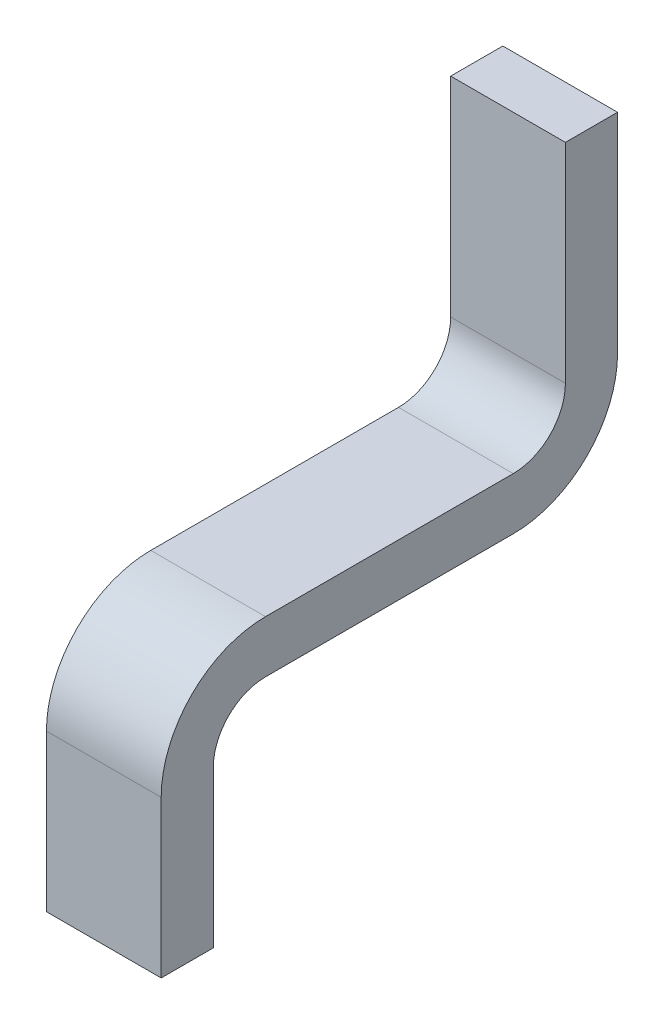
ISO-10303-21;
HEADER;
FILE_DESCRIPTION(('STEP AP214'),'2;1');
FILE_NAME('part.step','',(''),(''),'','','');
FILE_SCHEMA(('AUTOMOTIVE_DESIGN { 1 0 10303 214 1 1 1 1 }'));
ENDSEC;
DATA;
#1=APPLICATION_CONTEXT('core data for automotive mechanical design processes');
#2=APPLICATION_PROTOCOL_DEFINITION('international standard','automotive_design',2000,#1);
#3=PRODUCT_CONTEXT('',#1,'mechanical');
#4=PRODUCT('Part','Part','',(#3));
#5=PRODUCT_RELATED_PRODUCT_CATEGORY('part','',(#4));
#6=PRODUCT_DEFINITION_FORMATION('','',#4);
#7=PRODUCT_DEFINITION_CONTEXT('part definition',#1,'design');
#8=PRODUCT_DEFINITION('design','',#6,#7);
#9=PRODUCT_DEFINITION_SHAPE('','',#8);
#10=(LENGTH_UNIT() NAMED_UNIT(*) SI_UNIT(.MILLI.,.METRE.));
#11=(NAMED_UNIT(*) PLANE_ANGLE_UNIT() SI_UNIT($,.RADIAN.));
#12=(NAMED_UNIT(*) SI_UNIT($,.STERADIAN.) SOLID_ANGLE_UNIT());
#13=UNCERTAINTY_MEASURE_WITH_UNIT(LENGTH_MEASURE(1.E-05),#10,'distance_accuracy_value','');
#14=(GEOMETRIC_REPRESENTATION_CONTEXT(3) GLOBAL_UNCERTAINTY_ASSIGNED_CONTEXT((#13)) GLOBAL_UNIT_ASSIGNED_CONTEXT((#10,
#11,#12)) REPRESENTATION_CONTEXT('',''));
#15=CARTESIAN_POINT('',(0.,0.,0.));
#16=DIRECTION('',(0.,0.,1.));
#17=DIRECTION('',(1.,0.,0.));
#18=AXIS2_PLACEMENT_3D('',#15,#16,#17);
#19=CARTESIAN_POINT('',(1.86,4.,0.675));
#20=DIRECTION('',(-1.,0.,0.));
#21=DIRECTION('',(0.,-1.,0.));
#22=AXIS2_PLACEMENT_3D('',#19,#20,#21);
#23=PLANE('',#22);
#24=CARTESIAN_POINT('',(1.86,3.8,0.675));
#25=DIRECTION('',(1.,0.,0.));
#26=DIRECTION('',(0.,1.,0.));
#27=AXIS2_PLACEMENT_3D('',#24,#25,#26);
#28=CIRCLE('',#27,0.2);
#29=CARTESIAN_POINT('',(1.86,3.8,0.875));
#30=VERTEX_POINT('',#29);
#31=CARTESIAN_POINT('',(1.86,4.,0.675));
#32=VERTEX_POINT('',#31);
#33=EDGE_CURVE('E150',#30,#32,#28,.F.);
#34=ORIENTED_EDGE('',*,*,#33,.F.);
#35=DIRECTION('',(0.,1.,0.));
#36=VECTOR('',#35,1.);
#37=CARTESIAN_POINT('',(1.86,3.50000000000001,0.875));
#38=LINE('',#37,#36);
#39=CARTESIAN_POINT('',(1.86,3.50000000000001,0.875));
#40=VERTEX_POINT('',#39);
#41=EDGE_CURVE('E147',#30,#40,#38,.F.);
#42=ORIENTED_EDGE('',*,*,#41,.T.);
#43=DIRECTION('',(0.,0.,1.));
#44=VECTOR('',#43,1.);
#45=CARTESIAN_POINT('',(1.86,3.50000000000001,0.775));
#46=LINE('',#45,#44);
#47=CARTESIAN_POINT('',(1.86,3.50000000000001,0.775));
#48=VERTEX_POINT('',#47);
#49=EDGE_CURVE('E141',#48,#40,#46,.T.);
#50=ORIENTED_EDGE('',*,*,#49,.F.);
#51=DIRECTION('',(0.,1.,0.));
#52=VECTOR('',#51,1.);
#53=CARTESIAN_POINT('',(1.86,3.50000000000001,0.775));
#54=LINE('',#53,#52);
#55=CARTESIAN_POINT('',(1.86,3.8,0.775));
#56=VERTEX_POINT('',#55);
#57=EDGE_CURVE('E115',#48,#56,#54,.T.);
#58=ORIENTED_EDGE('',*,*,#57,.T.);
#59=CARTESIAN_POINT('',(1.86,3.8,0.675));
#60=DIRECTION('',(1.,0.,0.));
#61=DIRECTION('',(0.,1.,0.));
#62=AXIS2_PLACEMENT_3D('',#59,#60,#61);
#63=CIRCLE('',#62,0.1);
#64=CARTESIAN_POINT('',(1.86,3.9,0.675));
#65=VERTEX_POINT('',#64);
#66=EDGE_CURVE('E215',#56,#65,#63,.F.);
#67=ORIENTED_EDGE('',*,*,#66,.T.);
#68=DIRECTION('',(0.,0.,1.));
#69=VECTOR('',#68,1.);
#70=CARTESIAN_POINT('',(1.86,3.9,0.675));
#71=LINE('',#70,#69);
#72=CARTESIAN_POINT('',(1.86,3.9,0.2));
#73=VERTEX_POINT('',#72);
#74=EDGE_CURVE('E181',#65,#73,#71,.F.);
#75=ORIENTED_EDGE('',*,*,#74,.T.);
#76=CARTESIAN_POINT('',(1.86,4.1,0.2));
#77=DIRECTION('',(-1.,0.,0.));
#78=DIRECTION('',(0.,-1.,0.));
#79=AXIS2_PLACEMENT_3D('',#76,#77,#78);
#80=CIRCLE('',#79,0.2);
#81=CARTESIAN_POINT('',(1.86,4.1,0.));
#82=VERTEX_POINT('',#81);
#83=EDGE_CURVE('E20',#82,#73,#80,.T.);
#84=ORIENTED_EDGE('',*,*,#83,.F.);
#85=DIRECTION('',(0.,1.,0.));
#86=VECTOR('',#85,1.);
#87=CARTESIAN_POINT('',(1.86,4.1,0.));
#88=LINE('',#87,#86);
#89=CARTESIAN_POINT('',(1.86,4.5,0.));
#90=VERTEX_POINT('',#89);
#91=EDGE_CURVE('E91',#82,#90,#88,.T.);
#92=ORIENTED_EDGE('',*,*,#91,.T.);
#93=DIRECTION('',(0.,0.,1.));
#94=VECTOR('',#93,1.);
#95=CARTESIAN_POINT('',(1.86,4.5,0.));
#96=LINE('',#95,#94);
#97=CARTESIAN_POINT('',(1.86,4.5,0.1));
#98=VERTEX_POINT('',#97);
#99=EDGE_CURVE('E163',#90,#98,#96,.T.);
#100=ORIENTED_EDGE('',*,*,#99,.T.);
#101=DIRECTION('',(0.,1.,0.));
#102=VECTOR('',#101,1.);
#103=CARTESIAN_POINT('',(1.86,4.1,0.1));
#104=LINE('',#103,#102);
#105=CARTESIAN_POINT('',(1.86,4.1,0.1));
#106=VERTEX_POINT('',#105);
#107=EDGE_CURVE('E159',#98,#106,#104,.F.);
#108=ORIENTED_EDGE('',*,*,#107,.T.);
#109=CARTESIAN_POINT('',(1.86,4.1,0.2));
#110=DIRECTION('',(-1.,0.,0.));
#111=DIRECTION('',(0.,-1.,0.));
#112=AXIS2_PLACEMENT_3D('',#109,#110,#111);
#113=CIRCLE('',#112,0.1);
#114=CARTESIAN_POINT('',(1.86,4.,0.2));
#115=VERTEX_POINT('',#114);
#116=EDGE_CURVE('E155',#106,#115,#113,.T.);
#117=ORIENTED_EDGE('',*,*,#116,.T.);
#118=DIRECTION('',(0.,0.,1.));
#119=VECTOR('',#118,1.);
#120=CARTESIAN_POINT('',(1.86,4.,0.675));
#121=LINE('',#120,#119);
#122=EDGE_CURVE('E154',#115,#32,#121,.T.);
#123=ORIENTED_EDGE('',*,*,#122,.T.);
#124=EDGE_LOOP('',(#34,#42,#50,#58,#67,#75,#84,#92,#100,#108,#117,#123));
#125=FACE_BOUND('',#124,.T.);
#126=ADVANCED_FACE('F17',(#125),#23,.F.);
#127=CARTESIAN_POINT('',(1.86,4.1,0.2));
#128=DIRECTION('',(-1.,0.,0.));
#129=DIRECTION('',(0.,-1.,0.));
#130=AXIS2_PLACEMENT_3D('',#127,#128,#129);
#131=CYLINDRICAL_SURFACE('',#130,0.2);
#132=CARTESIAN_POINT('',(1.64,4.1,0.2));
#133=DIRECTION('',(-1.,0.,0.));
#134=DIRECTION('',(0.,-1.,0.));
#135=AXIS2_PLACEMENT_3D('',#132,#133,#134);
#136=CIRCLE('',#135,0.2);
#137=CARTESIAN_POINT('',(1.64,3.90000000000001,0.2));
#138=VERTEX_POINT('',#137);
#139=CARTESIAN_POINT('',(1.64,4.1,0.));
#140=VERTEX_POINT('',#139);
#141=EDGE_CURVE('E183',#138,#140,#136,.F.);
#142=ORIENTED_EDGE('',*,*,#141,.T.);
#143=DIRECTION('',(1.,0.,0.));
#144=VECTOR('',#143,1.);
#145=CARTESIAN_POINT('',(1.86,4.1,0.));
#146=LINE('',#145,#144);
#147=EDGE_CURVE('E178',#140,#82,#146,.T.);
#148=ORIENTED_EDGE('',*,*,#147,.T.);
#149=ORIENTED_EDGE('',*,*,#83,.T.);
#150=DIRECTION('',(-1.,0.,0.));
#151=VECTOR('',#150,1.);
#152=CARTESIAN_POINT('',(1.86,3.9,0.2));
#153=LINE('',#152,#151);
#154=EDGE_CURVE('E217',#73,#138,#153,.T.);
#155=ORIENTED_EDGE('',*,*,#154,.T.);
#156=EDGE_LOOP('',(#142,#148,#149,#155));
#157=FACE_BOUND('',#156,.T.);
#158=ADVANCED_FACE('F254',(#157),#131,.T.);
#159=CARTESIAN_POINT('',(1.86,4.1,0.));
#160=DIRECTION('',(0.,0.,1.));
#161=DIRECTION('',(1.,0.,0.));
#162=AXIS2_PLACEMENT_3D('',#159,#160,#161);
#163=PLANE('',#162);
#164=ORIENTED_EDGE('',*,*,#147,.F.);
#165=DIRECTION('',(0.,1.,0.));
#166=VECTOR('',#165,1.);
#167=CARTESIAN_POINT('',(1.64,3.90000000000001,0.));
#168=LINE('',#167,#166);
#169=CARTESIAN_POINT('',(1.64,4.5,0.));
#170=VERTEX_POINT('',#169);
#171=EDGE_CURVE('E170',#140,#170,#168,.T.);
#172=ORIENTED_EDGE('',*,*,#171,.T.);
#173=DIRECTION('',(1.,0.,0.));
#174=VECTOR('',#173,1.);
#175=CARTESIAN_POINT('',(1.86,4.5,0.));
#176=LINE('',#175,#174);
#177=EDGE_CURVE('E173',#170,#90,#176,.T.);
#178=ORIENTED_EDGE('',*,*,#177,.T.);
#179=ORIENTED_EDGE('',*,*,#91,.F.);
#180=EDGE_LOOP('',(#164,#172,#178,#179));
#181=FACE_BOUND('',#180,.T.);
#182=ADVANCED_FACE('F257',(#181),#163,.F.);
#183=CARTESIAN_POINT('',(1.86,4.5,0.));
#184=DIRECTION('',(0.,-1.,0.));
#185=DIRECTION('',(1.,0.,0.));
#186=AXIS2_PLACEMENT_3D('',#183,#184,#185);
#187=PLANE('',#186);
#188=DIRECTION('',(-1.,0.,0.));
#189=VECTOR('',#188,1.);
#190=CARTESIAN_POINT('',(1.64,4.5,0.1));
#191=LINE('',#190,#189);
#192=CARTESIAN_POINT('',(1.64,4.5,0.1));
#193=VERTEX_POINT('',#192);
#194=EDGE_CURVE('E160',#193,#98,#191,.F.);
#195=ORIENTED_EDGE('',*,*,#194,.T.);
#196=ORIENTED_EDGE('',*,*,#99,.F.);
#197=ORIENTED_EDGE('',*,*,#177,.F.);
#198=DIRECTION('',(0.,0.,1.));
#199=VECTOR('',#198,1.);
#200=CARTESIAN_POINT('',(1.64,4.5,0.675));
#201=LINE('',#200,#199);
#202=EDGE_CURVE('E166',#170,#193,#201,.T.);
#203=ORIENTED_EDGE('',*,*,#202,.T.);
#204=EDGE_LOOP('',(#195,#196,#197,#203));
#205=FACE_BOUND('',#204,.T.);
#206=ADVANCED_FACE('F259',(#205),#187,.F.);
#207=CARTESIAN_POINT('',(1.64,4.1,0.1));
#208=DIRECTION('',(0.,0.,-1.));
#209=DIRECTION('',(-1.,0.,0.));
#210=AXIS2_PLACEMENT_3D('',#207,#208,#209);
#211=PLANE('',#210);
#212=DIRECTION('',(-1.,0.,0.));
#213=VECTOR('',#212,1.);
#214=CARTESIAN_POINT('',(1.64,4.1,0.1));
#215=LINE('',#214,#213);
#216=CARTESIAN_POINT('',(1.64,4.1,0.1));
#217=VERTEX_POINT('',#216);
#218=EDGE_CURVE('E156',#217,#106,#215,.F.);
#219=ORIENTED_EDGE('',*,*,#218,.T.);
#220=ORIENTED_EDGE('',*,*,#107,.F.);
#221=ORIENTED_EDGE('',*,*,#194,.F.);
#222=DIRECTION('',(0.,1.,0.));
#223=VECTOR('',#222,1.);
#224=CARTESIAN_POINT('',(1.64,3.90000000000001,0.1));
#225=LINE('',#224,#223);
#226=EDGE_CURVE('E169',#193,#217,#225,.F.);
#227=ORIENTED_EDGE('',*,*,#226,.T.);
#228=EDGE_LOOP('',(#219,#220,#221,#227));
#229=FACE_BOUND('',#228,.T.);
#230=ADVANCED_FACE('F234',(#229),#211,.F.);
#231=CARTESIAN_POINT('',(1.64,4.1,0.2));
#232=DIRECTION('',(-1.,0.,0.));
#233=DIRECTION('',(0.,-1.,0.));
#234=AXIS2_PLACEMENT_3D('',#231,#232,#233);
#235=CYLINDRICAL_SURFACE('',#234,0.1);
#236=DIRECTION('',(1.,0.,0.));
#237=VECTOR('',#236,1.);
#238=CARTESIAN_POINT('',(1.64,4.,0.2));
#239=LINE('',#238,#237);
#240=CARTESIAN_POINT('',(1.64,4.,0.2));
#241=VERTEX_POINT('',#240);
#242=EDGE_CURVE('E151',#241,#115,#239,.T.);
#243=ORIENTED_EDGE('',*,*,#242,.T.);
#244=ORIENTED_EDGE('',*,*,#116,.F.);
#245=ORIENTED_EDGE('',*,*,#218,.F.);
#246=CARTESIAN_POINT('',(1.64,4.1,0.2));
#247=DIRECTION('',(-1.,0.,0.));
#248=DIRECTION('',(0.,-1.,0.));
#249=AXIS2_PLACEMENT_3D('',#246,#247,#248);
#250=CIRCLE('',#249,0.1);
#251=EDGE_CURVE('E210',#217,#241,#250,.T.);
#252=ORIENTED_EDGE('',*,*,#251,.T.);
#253=EDGE_LOOP('',(#243,#244,#245,#252));
#254=FACE_BOUND('',#253,.T.);
#255=ADVANCED_FACE('F227',(#254),#235,.F.);
#256=CARTESIAN_POINT('',(1.64,4.,0.675));
#257=DIRECTION('',(0.,-1.,0.));
#258=DIRECTION('',(1.,0.,0.));
#259=AXIS2_PLACEMENT_3D('',#256,#257,#258);
#260=PLANE('',#259);
#261=DIRECTION('',(1.,0.,0.));
#262=VECTOR('',#261,1.);
#263=CARTESIAN_POINT('',(1.64,4.,0.675));
#264=LINE('',#263,#262);
#265=CARTESIAN_POINT('',(1.64,4.,0.675));
#266=VERTEX_POINT('',#265);
#267=EDGE_CURVE('E148',#32,#266,#264,.F.);
#268=ORIENTED_EDGE('',*,*,#267,.F.);
#269=ORIENTED_EDGE('',*,*,#122,.F.);
#270=ORIENTED_EDGE('',*,*,#242,.F.);
#271=DIRECTION('',(0.,0.,1.));
#272=VECTOR('',#271,1.);
#273=CARTESIAN_POINT('',(1.64,4.,0.675));
#274=LINE('',#273,#272);
#275=EDGE_CURVE('E209',#241,#266,#274,.T.);
#276=ORIENTED_EDGE('',*,*,#275,.T.);
#277=EDGE_LOOP('',(#268,#269,#270,#276));
#278=FACE_BOUND('',#277,.T.);
#279=ADVANCED_FACE('F224',(#278),#260,.F.);
#280=CARTESIAN_POINT('',(1.64,3.8,0.675));
#281=DIRECTION('',(1.,0.,0.));
#282=DIRECTION('',(0.,1.,0.));
#283=AXIS2_PLACEMENT_3D('',#280,#281,#282);
#284=CYLINDRICAL_SURFACE('',#283,0.2);
#285=ORIENTED_EDGE('',*,*,#33,.T.);
#286=ORIENTED_EDGE('',*,*,#267,.T.);
#287=CARTESIAN_POINT('',(1.64,3.8,0.675));
#288=DIRECTION('',(1.,0.,0.));
#289=DIRECTION('',(0.,1.,0.));
#290=AXIS2_PLACEMENT_3D('',#287,#288,#289);
#291=CIRCLE('',#290,0.2);
#292=CARTESIAN_POINT('',(1.64,3.8,0.875));
#293=VERTEX_POINT('',#292);
#294=EDGE_CURVE('E133',#266,#293,#291,.T.);
#295=ORIENTED_EDGE('',*,*,#294,.T.);
#296=DIRECTION('',(-1.,0.,0.));
#297=VECTOR('',#296,1.);
#298=CARTESIAN_POINT('',(1.64,3.8,0.875));
#299=LINE('',#298,#297);
#300=EDGE_CURVE('E144',#293,#30,#299,.F.);
#301=ORIENTED_EDGE('',*,*,#300,.T.);
#302=EDGE_LOOP('',(#285,#286,#295,#301));
#303=FACE_BOUND('',#302,.T.);
#304=ADVANCED_FACE('F285',(#303),#284,.T.);
#305=CARTESIAN_POINT('',(1.64,3.50000000000001,0.875));
#306=DIRECTION('',(0.,0.,-1.));
#307=DIRECTION('',(-1.,0.,0.));
#308=AXIS2_PLACEMENT_3D('',#305,#306,#307);
#309=PLANE('',#308);
#310=DIRECTION('',(1.,0.,0.));
#311=VECTOR('',#310,1.);
#312=CARTESIAN_POINT('',(1.86,3.50000000000001,0.875));
#313=LINE('',#312,#311);
#314=CARTESIAN_POINT('',(1.64,3.50000000000001,0.875));
#315=VERTEX_POINT('',#314);
#316=EDGE_CURVE('E118',#40,#315,#313,.F.);
#317=ORIENTED_EDGE('',*,*,#316,.F.);
#318=ORIENTED_EDGE('',*,*,#41,.F.);
#319=ORIENTED_EDGE('',*,*,#300,.F.);
#320=DIRECTION('',(0.,1.,0.));
#321=VECTOR('',#320,1.);
#322=CARTESIAN_POINT('',(1.64,3.90000000000001,0.875));
#323=LINE('',#322,#321);
#324=EDGE_CURVE('E131',#293,#315,#323,.F.);
#325=ORIENTED_EDGE('',*,*,#324,.T.);
#326=EDGE_LOOP('',(#317,#318,#319,#325));
#327=FACE_BOUND('',#326,.T.);
#328=ADVANCED_FACE('F282',(#327),#309,.F.);
#329=CARTESIAN_POINT('',(1.86,3.50000000000001,0.775));
#330=DIRECTION('',(0.,-1.,0.));
#331=DIRECTION('',(1.,0.,0.));
#332=AXIS2_PLACEMENT_3D('',#329,#330,#331);
#333=PLANE('',#332);
#334=ORIENTED_EDGE('',*,*,#49,.T.);
#335=ORIENTED_EDGE('',*,*,#316,.T.);
#336=DIRECTION('',(0.,0.,1.));
#337=VECTOR('',#336,1.);
#338=CARTESIAN_POINT('',(1.64,3.50000000000001,0.675));
#339=LINE('',#338,#337);
#340=CARTESIAN_POINT('',(1.64,3.50000000000001,0.775));
#341=VERTEX_POINT('',#340);
#342=EDGE_CURVE('E125',#315,#341,#339,.F.);
#343=ORIENTED_EDGE('',*,*,#342,.T.);
#344=DIRECTION('',(1.,0.,0.));
#345=VECTOR('',#344,1.);
#346=CARTESIAN_POINT('',(1.86,3.50000000000001,0.775));
#347=LINE('',#346,#345);
#348=EDGE_CURVE('E110',#341,#48,#347,.T.);
#349=ORIENTED_EDGE('',*,*,#348,.T.);
#350=EDGE_LOOP('',(#334,#335,#343,#349));
#351=FACE_BOUND('',#350,.T.);
#352=ADVANCED_FACE('F129',(#351),#333,.T.);
#353=CARTESIAN_POINT('',(1.86,3.50000000000001,0.775));
#354=DIRECTION('',(0.,0.,1.));
#355=DIRECTION('',(1.,0.,0.));
#356=AXIS2_PLACEMENT_3D('',#353,#354,#355);
#357=PLANE('',#356);
#358=ORIENTED_EDGE('',*,*,#348,.F.);
#359=DIRECTION('',(0.,1.,0.));
#360=VECTOR('',#359,1.);
#361=CARTESIAN_POINT('',(1.64,3.90000000000001,0.775));
#362=LINE('',#361,#360);
#363=CARTESIAN_POINT('',(1.64,3.8,0.775));
#364=VERTEX_POINT('',#363);
#365=EDGE_CURVE('E114',#341,#364,#362,.T.);
#366=ORIENTED_EDGE('',*,*,#365,.T.);
#367=DIRECTION('',(1.,0.,0.));
#368=VECTOR('',#367,1.);
#369=CARTESIAN_POINT('',(1.86,3.8,0.775));
#370=LINE('',#369,#368);
#371=EDGE_CURVE('E185',#364,#56,#370,.T.);
#372=ORIENTED_EDGE('',*,*,#371,.T.);
#373=ORIENTED_EDGE('',*,*,#57,.F.);
#374=EDGE_LOOP('',(#358,#366,#372,#373));
#375=FACE_BOUND('',#374,.T.);
#376=ADVANCED_FACE('F112',(#375),#357,.F.);
#377=CARTESIAN_POINT('',(1.86,3.8,0.675));
#378=DIRECTION('',(1.,0.,0.));
#379=DIRECTION('',(0.,1.,0.));
#380=AXIS2_PLACEMENT_3D('',#377,#378,#379);
#381=CYLINDRICAL_SURFACE('',#380,0.1);
#382=ORIENTED_EDGE('',*,*,#371,.F.);
#383=CARTESIAN_POINT('',(1.64,3.8,0.675));
#384=DIRECTION('',(1.,0.,0.));
#385=DIRECTION('',(0.,1.,0.));
#386=AXIS2_PLACEMENT_3D('',#383,#384,#385);
#387=CIRCLE('',#386,0.1);
#388=CARTESIAN_POINT('',(1.64,3.90000000000001,0.675));
#389=VERTEX_POINT('',#388);
#390=EDGE_CURVE('E26',#364,#389,#387,.F.);
#391=ORIENTED_EDGE('',*,*,#390,.T.);
#392=DIRECTION('',(-1.,0.,0.));
#393=VECTOR('',#392,1.);
#394=CARTESIAN_POINT('',(1.86,3.9,0.675));
#395=LINE('',#394,#393);
#396=EDGE_CURVE('E34',#389,#65,#395,.F.);
#397=ORIENTED_EDGE('',*,*,#396,.T.);
#398=ORIENTED_EDGE('',*,*,#66,.F.);
#399=EDGE_LOOP('',(#382,#391,#397,#398));
#400=FACE_BOUND('',#399,.T.);
#401=ADVANCED_FACE('F250',(#400),#381,.F.);
#402=CARTESIAN_POINT('',(1.86,3.9,0.675));
#403=DIRECTION('',(0.,1.,0.));
#404=DIRECTION('',(-1.,0.,0.));
#405=AXIS2_PLACEMENT_3D('',#402,#403,#404);
#406=PLANE('',#405);
#407=ORIENTED_EDGE('',*,*,#396,.F.);
#408=DIRECTION('',(0.,0.,1.));
#409=VECTOR('',#408,1.);
#410=CARTESIAN_POINT('',(1.64,3.90000000000001,0.675));
#411=LINE('',#410,#409);
#412=EDGE_CURVE('E11',#389,#138,#411,.F.);
#413=ORIENTED_EDGE('',*,*,#412,.T.);
#414=ORIENTED_EDGE('',*,*,#154,.F.);
#415=ORIENTED_EDGE('',*,*,#74,.F.);
#416=EDGE_LOOP('',(#407,#413,#414,#415));
#417=FACE_BOUND('',#416,.T.);
#418=ADVANCED_FACE('F252',(#417),#406,.F.);
#419=CARTESIAN_POINT('',(1.64,3.90000000000001,0.675));
#420=DIRECTION('',(1.,0.,0.));
#421=DIRECTION('',(0.,1.,0.));
#422=AXIS2_PLACEMENT_3D('',#419,#420,#421);
#423=PLANE('',#422);
#424=ORIENTED_EDGE('',*,*,#390,.F.);
#425=ORIENTED_EDGE('',*,*,#365,.F.);
#426=ORIENTED_EDGE('',*,*,#342,.F.);
#427=ORIENTED_EDGE('',*,*,#324,.F.);
#428=ORIENTED_EDGE('',*,*,#294,.F.);
#429=ORIENTED_EDGE('',*,*,#275,.F.);
#430=ORIENTED_EDGE('',*,*,#251,.F.);
#431=ORIENTED_EDGE('',*,*,#226,.F.);
#432=ORIENTED_EDGE('',*,*,#202,.F.);
#433=ORIENTED_EDGE('',*,*,#171,.F.);
#434=ORIENTED_EDGE('',*,*,#141,.F.);
#435=ORIENTED_EDGE('',*,*,#412,.F.);
#436=EDGE_LOOP('',(#424,#425,#426,#427,#428,#429,#430,#431,#432,#433,#434,#435));
#437=FACE_BOUND('',#436,.T.);
#438=ADVANCED_FACE('F123',(#437),#423,.F.);
#439=CLOSED_SHELL('',(#126,#158,#182,#206,#230,#255,#279,#304,#328,#352,#376,#401,#418,#438));
#440=MANIFOLD_SOLID_BREP('B1',#439);
#441=ADVANCED_BREP_SHAPE_REPRESENTATION('',(#18,#440),#14);
#442=SHAPE_DEFINITION_REPRESENTATION(#9,#441);
ENDSEC;
END-ISO-10303-21;
